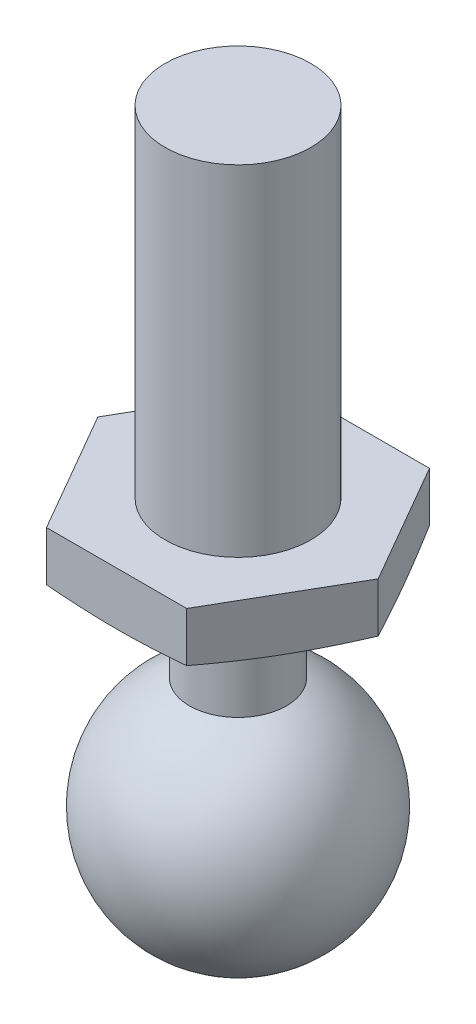
ISO-10303-21;
HEADER;
FILE_DESCRIPTION(('STEP AP214'),'2;1');
FILE_NAME('part.step','',(''),(''),'','','');
FILE_SCHEMA(('AUTOMOTIVE_DESIGN { 1 0 10303 214 1 1 1 1 }'));
ENDSEC;
DATA;
#1=APPLICATION_CONTEXT('core data for automotive mechanical design processes');
#2=APPLICATION_PROTOCOL_DEFINITION('international standard','automotive_design',2000,#1);
#3=PRODUCT_CONTEXT('',#1,'mechanical');
#4=PRODUCT('Part','Part','',(#3));
#5=PRODUCT_RELATED_PRODUCT_CATEGORY('part','',(#4));
#6=PRODUCT_DEFINITION_FORMATION('','',#4);
#7=PRODUCT_DEFINITION_CONTEXT('part definition',#1,'design');
#8=PRODUCT_DEFINITION('design','',#6,#7);
#9=PRODUCT_DEFINITION_SHAPE('','',#8);
#10=(LENGTH_UNIT() NAMED_UNIT(*) SI_UNIT(.MILLI.,.METRE.));
#11=(NAMED_UNIT(*) PLANE_ANGLE_UNIT() SI_UNIT($,.RADIAN.));
#12=(NAMED_UNIT(*) SI_UNIT($,.STERADIAN.) SOLID_ANGLE_UNIT());
#13=UNCERTAINTY_MEASURE_WITH_UNIT(LENGTH_MEASURE(1.E-05),#10,'distance_accuracy_value','');
#14=(GEOMETRIC_REPRESENTATION_CONTEXT(3) GLOBAL_UNCERTAINTY_ASSIGNED_CONTEXT((#13)) GLOBAL_UNIT_ASSIGNED_CONTEXT((#10,
#11,#12)) REPRESENTATION_CONTEXT('',''));
#15=CARTESIAN_POINT('',(0.,0.,0.));
#16=DIRECTION('',(0.,0.,1.));
#17=DIRECTION('',(1.,0.,0.));
#18=AXIS2_PLACEMENT_3D('',#15,#16,#17);
#19=CARTESIAN_POINT('',(0.,-1.35265396141693,0.));
#20=DIRECTION('',(0.,1.,0.));
#21=DIRECTION('',(0.,0.,1.));
#22=AXIS2_PLACEMENT_3D('',#19,#20,#21);
#23=CONICAL_SURFACE('',#22,1.,1.39626340159546);
#24=CARTESIAN_POINT('',(0.,-1.35265396141693,0.));
#25=DIRECTION('',(0.,-1.,0.));
#26=DIRECTION('',(0.,0.,-1.));
#27=AXIS2_PLACEMENT_3D('',#24,#25,#26);
#28=CIRCLE('',#27,1.);
#29=CARTESIAN_POINT('',(0.,-1.35265396141693,-1.));
#30=VERTEX_POINT('',#29);
#31=EDGE_CURVE('E46',#30,#30,#28,.T.);
#32=ORIENTED_EDGE('',*,*,#31,.F.);
#33=EDGE_LOOP('',(#32));
#34=FACE_BOUND('',#33,.T.);
#35=CARTESIAN_POINT('',(-4.35178786431024,-0.644036287997668,-2.5));
#36=CARTESIAN_POINT('',(-4.14193627308276,-0.676078443266939,-2.5));
#37=CARTESIAN_POINT('',(-3.9320061160949,-0.707637882512857,-2.5));
#38=CARTESIAN_POINT('',(-3.51189272953085,-0.769155320197357,-2.5));
#39=CARTESIAN_POINT('',(-3.30170947878789,-0.799113173573436,-2.5));
#40=CARTESIAN_POINT('',(-2.88017970644119,-0.856902233505525,-2.5));
#41=CARTESIAN_POINT('',(-2.66883192190967,-0.884724332295747,-2.5));
#42=CARTESIAN_POINT('',(-2.24570934242242,-0.937026760341865,-2.5));
#43=CARTESIAN_POINT('',(-2.03393453366674,-0.961506979784703,-2.5));
#44=CARTESIAN_POINT('',(-1.61240619275804,-1.00528012631561,-2.5));
#45=CARTESIAN_POINT('',(-1.40265893021013,-1.02463181983137,-2.5));
#46=CARTESIAN_POINT('',(-0.982648208636613,-1.05650898579663,-2.5));
#47=CARTESIAN_POINT('',(-0.772384815017567,-1.06903528244204,-2.5));
#48=CARTESIAN_POINT('',(-0.351902634676422,-1.08527841598575,-2.5));
#49=CARTESIAN_POINT('',(-0.141684541141491,-1.08901216350975,-2.5));
#50=CARTESIAN_POINT('',(0.278709004327902,-1.08698381304818,-2.5));
#51=CARTESIAN_POINT('',(0.488884455296936,-1.08122151985331,-2.5));
#52=CARTESIAN_POINT('',(0.851230925027751,-1.06403759142698,-2.5));
#53=CARTESIAN_POINT('',(1.00350351194761,-1.05460115450106,-2.5));
#54=CARTESIAN_POINT('',(1.30777400637347,-1.03208866040807,-2.5));
#55=CARTESIAN_POINT('',(1.45977191667072,-1.01901264043793,-2.5));
#56=CARTESIAN_POINT('',(1.76369841820404,-0.989977665999077,-2.5));
#57=CARTESIAN_POINT('',(1.91562662452937,-0.974014759231409,-2.5));
#58=CARTESIAN_POINT('',(2.2192375794225,-0.939897479711876,-2.5));
#59=CARTESIAN_POINT('',(2.37092032222341,-0.921743056208982,-2.5));
#60=CARTESIAN_POINT('',(2.67545249374304,-0.883603602011488,-2.5));
#61=CARTESIAN_POINT('',(2.82830001269499,-0.863603448459441,-2.5));
#62=CARTESIAN_POINT('',(3.13382217763901,-0.822324887162011,-2.5));
#63=CARTESIAN_POINT('',(3.28649682274871,-0.801046472921989,-2.5));
#64=CARTESIAN_POINT('',(3.59133987058711,-0.757569470849809,-2.5));
#65=CARTESIAN_POINT('',(3.74350860797057,-0.73537321814211,-2.5));
#66=CARTESIAN_POINT('',(4.04772858121144,-0.690221922288668,-2.5));
#67=CARTESIAN_POINT('',(4.19977982073275,-0.667266903868236,-2.5));
#68=CARTESIAN_POINT('',(4.35178786431024,-0.644036287997668,-2.5));
#69=B_SPLINE_CURVE_WITH_KNOTS('',3,(#35,#36,#37,#38,#39,#40,#41,#42,#43,#44,#45,#46,#47,#48,#49,
#50,#51,#52,#53,#54,#55,#56,#57,#58,#59,#60,#61,#62,#63,#64,#65,#66,#67,#68),.UNSPECIFIED.,.F.,
.F.,(4,2,2,2,2,2,2,2,2,2,2,2,2,2,2,2,4),(0.,0.636857995492099,1.27377357655624,1.91326959648742,
2.55278662499233,3.18462332153686,3.81638370417504,4.44692803219513,5.07748532242267,
5.53513200560773,5.9927740117676,6.45104736316598,6.90933132927127,7.37177581489304,
7.83422265032084,8.29555773886521,8.75687780903008),.UNSPECIFIED.);
#70=CARTESIAN_POINT('',(-1.44337567297406,-1.01996879323826,-2.5));
#71=VERTEX_POINT('',#70);
#72=CARTESIAN_POINT('',(1.44337567297407,-1.01996879323827,-2.5));
#73=VERTEX_POINT('',#72);
#74=EDGE_CURVE('E124',#71,#73,#69,.T.);
#75=ORIENTED_EDGE('',*,*,#74,.T.);
#76=CARTESIAN_POINT('',(1.44326020292023,-1.01994843153073,-2.5002));
#77=CARTESIAN_POINT('',(1.50332291805887,-1.03054468375176,-2.39616832573933));
#78=CARTESIAN_POINT('',(1.56343325575889,-1.04015113253336,-2.29205416678277));
#79=CARTESIAN_POINT('',(1.68374601000383,-1.0570130855626,-2.08366636363198));
#80=CARTESIAN_POINT('',(1.74394844050654,-1.06426818850539,-1.97939269526217));
#81=CARTESIAN_POINT('',(1.86428642853012,-1.07603900982871,-1.77096118592471));
#82=CARTESIAN_POINT('',(1.92442183257639,-1.08056084399192,-1.66680361078289));
#83=CARTESIAN_POINT('',(2.04472599629783,-1.08662296361426,-1.45843068685527));
#84=CARTESIAN_POINT('',(2.10489475287946,-1.08816349035423,-1.35421534342763));
#85=CARTESIAN_POINT('',(2.22523226604273,-1.08816349035423,-1.14578465657237));
#86=CARTESIAN_POINT('',(2.28540102262436,-1.08662296361426,-1.04156931314473));
#87=CARTESIAN_POINT('',(2.4057051863458,-1.08056084399192,-0.833196389217114));
#88=CARTESIAN_POINT('',(2.46584059039207,-1.07603900982871,-0.729038814075291));
#89=CARTESIAN_POINT('',(2.58617857841566,-1.06426818850539,-0.520607304737831));
#90=CARTESIAN_POINT('',(2.64638100891836,-1.0570130855626,-0.416333636368015));
#91=CARTESIAN_POINT('',(2.7666937631633,-1.04015113253336,-0.20794583321723));
#92=CARTESIAN_POINT('',(2.82680410086332,-1.03054468375176,-0.103831674260672));
#93=CARTESIAN_POINT('',(2.88686681600197,-1.01994843153073,0.000200000000000127));
#94=B_SPLINE_CURVE_WITH_KNOTS('',3,(#76,#77,#78,#79,#80,#81,#82,#83,#84,#85,#86,#87,#88,#89,#90,
#91,#92,#93),.UNSPECIFIED.,.F.,.F.,(4,2,2,2,2,2,2,2,4),(0.,0.361783441417082,0.723628596038175,
1.08466108341276,1.44566435076637,1.80666761811999,2.16770010549457,2.52954526011567,
2.89132870153275),.UNSPECIFIED.);
#95=CARTESIAN_POINT('',(2.88675134594813,-1.01996879323826,0.));
#96=VERTEX_POINT('',#95);
#97=EDGE_CURVE('E162',#73,#96,#94,.T.);
#98=ORIENTED_EDGE('',*,*,#97,.T.);
#99=CARTESIAN_POINT('',(2.88686681600197,-1.01994843153073,-0.000199999999999913));
#100=CARTESIAN_POINT('',(2.82680410086332,-1.03054468375176,0.103831674260672));
#101=CARTESIAN_POINT('',(2.7666937631633,-1.04015113253336,0.20794583321723));
#102=CARTESIAN_POINT('',(2.64638100891836,-1.0570130855626,0.416333636368015));
#103=CARTESIAN_POINT('',(2.58617857841566,-1.06426818850539,0.520607304737831));
#104=CARTESIAN_POINT('',(2.46584059039207,-1.07603900982871,0.729038814075291));
#105=CARTESIAN_POINT('',(2.4057051863458,-1.08056084399192,0.833196389217114));
#106=CARTESIAN_POINT('',(2.28540102262436,-1.08662296361426,1.04156931314473));
#107=CARTESIAN_POINT('',(2.22523226604273,-1.08816349035423,1.14578465657237));
#108=CARTESIAN_POINT('',(2.10489475287946,-1.08816349035423,1.35421534342763));
#109=CARTESIAN_POINT('',(2.04472599629783,-1.08662296361426,1.45843068685527));
#110=CARTESIAN_POINT('',(1.92442183257639,-1.08056084399192,1.66680361078289));
#111=CARTESIAN_POINT('',(1.86428642853012,-1.07603900982871,1.77096118592471));
#112=CARTESIAN_POINT('',(1.74394844050654,-1.06426818850539,1.97939269526217));
#113=CARTESIAN_POINT('',(1.68374601000383,-1.0570130855626,2.08366636363198));
#114=CARTESIAN_POINT('',(1.56343325575889,-1.04015113253337,2.29205416678277));
#115=CARTESIAN_POINT('',(1.50332291805887,-1.03054468375176,2.39616832573933));
#116=CARTESIAN_POINT('',(1.44326020292023,-1.01994843153073,2.5002));
#117=B_SPLINE_CURVE_WITH_KNOTS('',3,(#99,#100,#101,#102,#103,#104,#105,#106,#107,#108,#109,#110,
#111,#112,#113,#114,#115,#116),.UNSPECIFIED.,.F.,.F.,(4,2,2,2,2,2,2,2,4),(0.,0.361783441417082,
0.723628596038174,1.08466108341276,1.44566435076637,1.80666761811999,2.16770010549457,
2.52954526011566,2.89132870153275),.UNSPECIFIED.);
#118=CARTESIAN_POINT('',(1.44337567297406,-1.01996879323826,2.5));
#119=VERTEX_POINT('',#118);
#120=EDGE_CURVE('E171',#96,#119,#117,.T.);
#121=ORIENTED_EDGE('',*,*,#120,.T.);
#122=CARTESIAN_POINT('',(4.35178786431024,-0.644036287997668,2.5));
#123=CARTESIAN_POINT('',(4.14193627308276,-0.676078443266939,2.5));
#124=CARTESIAN_POINT('',(3.9320061160949,-0.707637882512857,2.5));
#125=CARTESIAN_POINT('',(3.51189272953085,-0.769155320197357,2.5));
#126=CARTESIAN_POINT('',(3.30170947878789,-0.799113173573437,2.5));
#127=CARTESIAN_POINT('',(2.88017970644119,-0.856902233505525,2.5));
#128=CARTESIAN_POINT('',(2.66883192190967,-0.884724332295747,2.5));
#129=CARTESIAN_POINT('',(2.24570934242242,-0.937026760341865,2.5));
#130=CARTESIAN_POINT('',(2.03393453366674,-0.961506979784703,2.5));
#131=CARTESIAN_POINT('',(1.61240619275804,-1.00528012631561,2.5));
#132=CARTESIAN_POINT('',(1.40265893021013,-1.02463181983137,2.5));
#133=CARTESIAN_POINT('',(0.982648208636613,-1.05650898579663,2.5));
#134=CARTESIAN_POINT('',(0.772384815017566,-1.06903528244204,2.5));
#135=CARTESIAN_POINT('',(0.351902634676421,-1.08527841598575,2.5));
#136=CARTESIAN_POINT('',(0.141684541141491,-1.08901216350975,2.5));
#137=CARTESIAN_POINT('',(-0.278709004327902,-1.08698381304818,2.5));
#138=CARTESIAN_POINT('',(-0.488884455296937,-1.08122151985331,2.5));
#139=CARTESIAN_POINT('',(-0.851230925027751,-1.06403759142698,2.5));
#140=CARTESIAN_POINT('',(-1.00350351194761,-1.05460115450106,2.5));
#141=CARTESIAN_POINT('',(-1.30777400637347,-1.03208866040807,2.5));
#142=CARTESIAN_POINT('',(-1.45977191667072,-1.01901264043793,2.5));
#143=CARTESIAN_POINT('',(-1.76369841820404,-0.989977665999077,2.5));
#144=CARTESIAN_POINT('',(-1.91562662452937,-0.974014759231409,2.5));
#145=CARTESIAN_POINT('',(-2.2192375794225,-0.939897479711876,2.5));
#146=CARTESIAN_POINT('',(-2.37092032222341,-0.921743056208982,2.5));
#147=CARTESIAN_POINT('',(-2.67545249374304,-0.883603602011488,2.5));
#148=CARTESIAN_POINT('',(-2.82830001269499,-0.863603448459441,2.5));
#149=CARTESIAN_POINT('',(-3.13382217763901,-0.822324887162012,2.5));
#150=CARTESIAN_POINT('',(-3.28649682274871,-0.801046472921989,2.5));
#151=CARTESIAN_POINT('',(-3.59133987058711,-0.757569470849809,2.5));
#152=CARTESIAN_POINT('',(-3.74350860797057,-0.735373218142111,2.5));
#153=CARTESIAN_POINT('',(-4.04772858121144,-0.690221922288668,2.5));
#154=CARTESIAN_POINT('',(-4.19977982073275,-0.667266903868237,2.5));
#155=CARTESIAN_POINT('',(-4.35178786431024,-0.644036287997668,2.5));
#156=B_SPLINE_CURVE_WITH_KNOTS('',3,(#122,#123,#124,#125,#126,#127,#128,#129,#130,#131,#132,
#133,#134,#135,#136,#137,#138,#139,#140,#141,#142,#143,#144,#145,#146,#147,#148,#149,#150,#151,
#152,#153,#154,#155),.UNSPECIFIED.,.F.,.F.,(4,2,2,2,2,2,2,2,2,2,2,2,2,2,2,2,4),(0.,
0.636857995492099,1.27377357655623,1.91326959648742,2.55278662499233,3.18462332153686,
3.81638370417504,4.44692803219513,5.07748532242267,5.53513200560773,5.9927740117676,
6.45104736316598,6.90933132927127,7.37177581489304,7.83422265032084,8.29555773886521,
8.75687780903008),.UNSPECIFIED.);
#157=CARTESIAN_POINT('',(-1.44337567297406,-1.01996879323826,2.5));
#158=VERTEX_POINT('',#157);
#159=EDGE_CURVE('E196',#119,#158,#156,.T.);
#160=ORIENTED_EDGE('',*,*,#159,.T.);
#161=CARTESIAN_POINT('',(-1.44326020292023,-1.01994843153073,2.5002));
#162=CARTESIAN_POINT('',(-1.50332291805887,-1.03054468375176,2.39616832573933));
#163=CARTESIAN_POINT('',(-1.56343325575889,-1.04015113253337,2.29205416678277));
#164=CARTESIAN_POINT('',(-1.68374601000383,-1.0570130855626,2.08366636363198));
#165=CARTESIAN_POINT('',(-1.74394844050654,-1.06426818850539,1.97939269526217));
#166=CARTESIAN_POINT('',(-1.86428642853012,-1.07603900982871,1.77096118592471));
#167=CARTESIAN_POINT('',(-1.92442183257639,-1.08056084399192,1.66680361078289));
#168=CARTESIAN_POINT('',(-2.04472599629783,-1.08662296361426,1.45843068685527));
#169=CARTESIAN_POINT('',(-2.10489475287946,-1.08816349035423,1.35421534342763));
#170=CARTESIAN_POINT('',(-2.22523226604273,-1.08816349035423,1.14578465657237));
#171=CARTESIAN_POINT('',(-2.28540102262436,-1.08662296361426,1.04156931314473));
#172=CARTESIAN_POINT('',(-2.4057051863458,-1.08056084399192,0.833196389217114));
#173=CARTESIAN_POINT('',(-2.46584059039207,-1.07603900982871,0.729038814075291));
#174=CARTESIAN_POINT('',(-2.58617857841566,-1.06426818850539,0.520607304737831));
#175=CARTESIAN_POINT('',(-2.64638100891836,-1.0570130855626,0.416333636368015));
#176=CARTESIAN_POINT('',(-2.7666937631633,-1.04015113253336,0.20794583321723));
#177=CARTESIAN_POINT('',(-2.82680410086332,-1.03054468375176,0.103831674260671));
#178=CARTESIAN_POINT('',(-2.88686681600197,-1.01994843153073,-0.000200000000000699));
#179=B_SPLINE_CURVE_WITH_KNOTS('',3,(#161,#162,#163,#164,#165,#166,#167,#168,#169,#170,#171,
#172,#173,#174,#175,#176,#177,#178),.UNSPECIFIED.,.F.,.F.,(4,2,2,2,2,2,2,2,4),(0.,
0.361783441417082,0.723628596038174,1.08466108341276,1.44566435076637,1.80666761811999,
2.16770010549457,2.52954526011567,2.89132870153275),.UNSPECIFIED.);
#180=CARTESIAN_POINT('',(-2.88675134594813,-1.01996879323826,0.));
#181=VERTEX_POINT('',#180);
#182=EDGE_CURVE('E197',#158,#181,#179,.T.);
#183=ORIENTED_EDGE('',*,*,#182,.T.);
#184=CARTESIAN_POINT('',(-2.88686681600197,-1.01994843153073,0.00019999999999957));
#185=CARTESIAN_POINT('',(-2.82680410086332,-1.03054468375176,-0.103831674260672));
#186=CARTESIAN_POINT('',(-2.7666937631633,-1.04015113253336,-0.207945833217231));
#187=CARTESIAN_POINT('',(-2.64638100891836,-1.0570130855626,-0.416333636368015));
#188=CARTESIAN_POINT('',(-2.58617857841566,-1.06426818850539,-0.520607304737831));
#189=CARTESIAN_POINT('',(-2.46584059039207,-1.07603900982871,-0.729038814075291));
#190=CARTESIAN_POINT('',(-2.4057051863458,-1.08056084399192,-0.833196389217114));
#191=CARTESIAN_POINT('',(-2.28540102262436,-1.08662296361426,-1.04156931314473));
#192=CARTESIAN_POINT('',(-2.22523226604273,-1.08816349035423,-1.14578465657237));
#193=CARTESIAN_POINT('',(-2.10489475287946,-1.08816349035423,-1.35421534342763));
#194=CARTESIAN_POINT('',(-2.04472599629783,-1.08662296361426,-1.45843068685527));
#195=CARTESIAN_POINT('',(-1.92442183257639,-1.08056084399192,-1.66680361078289));
#196=CARTESIAN_POINT('',(-1.86428642853012,-1.07603900982871,-1.77096118592471));
#197=CARTESIAN_POINT('',(-1.74394844050654,-1.06426818850539,-1.97939269526217));
#198=CARTESIAN_POINT('',(-1.68374601000383,-1.0570130855626,-2.08366636363198));
#199=CARTESIAN_POINT('',(-1.56343325575889,-1.04015113253337,-2.29205416678277));
#200=CARTESIAN_POINT('',(-1.50332291805887,-1.03054468375176,-2.39616832573933));
#201=CARTESIAN_POINT('',(-1.44326020292023,-1.01994843153073,-2.5002));
#202=B_SPLINE_CURVE_WITH_KNOTS('',3,(#184,#185,#186,#187,#188,#189,#190,#191,#192,#193,#194,
#195,#196,#197,#198,#199,#200,#201),.UNSPECIFIED.,.F.,.F.,(4,2,2,2,2,2,2,2,4),(0.,
0.361783441417082,0.723628596038174,1.08466108341276,1.44566435076637,1.80666761811999,
2.16770010549457,2.52954526011566,2.89132870153275),.UNSPECIFIED.);
#203=EDGE_CURVE('E94',#181,#71,#202,.T.);
#204=ORIENTED_EDGE('',*,*,#203,.T.);
#205=EDGE_LOOP('',(#75,#98,#121,#160,#183,#204));
#206=FACE_BOUND('',#205,.T.);
#207=ADVANCED_FACE('F38',(#34,#206),#23,.T.);
#208=CARTESIAN_POINT('',(0.,-5.5,0.));
#209=DIRECTION('',(0.,-1.,0.));
#210=DIRECTION('',(0.,0.,1.));
#211=AXIS2_PLACEMENT_3D('',#208,#209,#210);
#212=SPHERICAL_SURFACE('',#211,2.5);
#213=CARTESIAN_POINT('',(0.,-3.20871215252208,0.));
#214=DIRECTION('',(0.,-1.,0.));
#215=DIRECTION('',(0.,0.,-1.));
#216=AXIS2_PLACEMENT_3D('',#213,#214,#215);
#217=CIRCLE('',#216,1.);
#218=CARTESIAN_POINT('',(0.,-3.20871215252208,-1.));
#219=VERTEX_POINT('',#218);
#220=EDGE_CURVE('E12',#219,#219,#217,.T.);
#221=ORIENTED_EDGE('',*,*,#220,.T.);
#222=EDGE_LOOP('',(#221));
#223=FACE_BOUND('',#222,.T.);
#224=ADVANCED_FACE('F40',(#223),#212,.T.);
#225=CARTESIAN_POINT('',(0.,-8.,0.));
#226=DIRECTION('',(0.,-1.,0.));
#227=DIRECTION('',(0.,0.,-1.));
#228=AXIS2_PLACEMENT_3D('',#225,#226,#227);
#229=CYLINDRICAL_SURFACE('',#228,1.);
#230=ORIENTED_EDGE('',*,*,#31,.T.);
#231=EDGE_LOOP('',(#230));
#232=FACE_BOUND('',#231,.T.);
#233=ORIENTED_EDGE('',*,*,#220,.F.);
#234=EDGE_LOOP('',(#233));
#235=FACE_BOUND('',#234,.T.);
#236=ADVANCED_FACE('F158',(#232,#235),#229,.T.);
#237=CARTESIAN_POINT('',(2.88675134594813,-2.,0.));
#238=DIRECTION('',(0.866025403784439,0.,-0.5));
#239=DIRECTION('',(-0.5,0.,-0.866025403784439));
#240=AXIS2_PLACEMENT_3D('',#237,#238,#239);
#241=PLANE('',#240);
#242=DIRECTION('',(0.,1.,0.));
#243=VECTOR('',#242,1.);
#244=CARTESIAN_POINT('',(1.44337567297406,-2.,-2.5));
#245=LINE('',#244,#243);
#246=CARTESIAN_POINT('',(1.44337567297406,0.,-2.5));
#247=VERTEX_POINT('',#246);
#248=EDGE_CURVE('E53',#73,#247,#245,.T.);
#249=ORIENTED_EDGE('',*,*,#248,.T.);
#250=DIRECTION('',(-0.5,0.,-0.866025403784439));
#251=VECTOR('',#250,1.);
#252=CARTESIAN_POINT('',(2.88675134594813,0.,0.));
#253=LINE('',#252,#251);
#254=CARTESIAN_POINT('',(2.88675134594813,0.,0.));
#255=VERTEX_POINT('',#254);
#256=EDGE_CURVE('E115',#255,#247,#253,.T.);
#257=ORIENTED_EDGE('',*,*,#256,.F.);
#258=DIRECTION('',(0.,1.,0.));
#259=VECTOR('',#258,1.);
#260=CARTESIAN_POINT('',(2.88675134594813,-2.,0.));
#261=LINE('',#260,#259);
#262=EDGE_CURVE('E122',#96,#255,#261,.T.);
#263=ORIENTED_EDGE('',*,*,#262,.F.);
#264=ORIENTED_EDGE('',*,*,#97,.F.);
#265=EDGE_LOOP('',(#249,#257,#263,#264));
#266=FACE_BOUND('',#265,.T.);
#267=ADVANCED_FACE('F153',(#266),#241,.T.);
#268=CARTESIAN_POINT('',(1.44337567297406,-2.,2.5));
#269=DIRECTION('',(0.866025403784439,0.,0.5));
#270=DIRECTION('',(0.5,0.,-0.866025403784439));
#271=AXIS2_PLACEMENT_3D('',#268,#269,#270);
#272=PLANE('',#271);
#273=ORIENTED_EDGE('',*,*,#262,.T.);
#274=DIRECTION('',(0.5,0.,-0.866025403784439));
#275=VECTOR('',#274,1.);
#276=CARTESIAN_POINT('',(1.44337567297406,0.,2.5));
#277=LINE('',#276,#275);
#278=CARTESIAN_POINT('',(1.44337567297406,0.,2.5));
#279=VERTEX_POINT('',#278);
#280=EDGE_CURVE('E120',#279,#255,#277,.T.);
#281=ORIENTED_EDGE('',*,*,#280,.F.);
#282=DIRECTION('',(0.,1.,0.));
#283=VECTOR('',#282,1.);
#284=CARTESIAN_POINT('',(1.44337567297406,-2.,2.5));
#285=LINE('',#284,#283);
#286=EDGE_CURVE('E125',#119,#279,#285,.T.);
#287=ORIENTED_EDGE('',*,*,#286,.F.);
#288=ORIENTED_EDGE('',*,*,#120,.F.);
#289=EDGE_LOOP('',(#273,#281,#287,#288));
#290=FACE_BOUND('',#289,.T.);
#291=ADVANCED_FACE('F157',(#290),#272,.T.);
#292=CARTESIAN_POINT('',(-1.44337567297406,-2.,2.5));
#293=DIRECTION('',(0.,0.,1.));
#294=DIRECTION('',(1.,0.,0.));
#295=AXIS2_PLACEMENT_3D('',#292,#293,#294);
#296=PLANE('',#295);
#297=ORIENTED_EDGE('',*,*,#286,.T.);
#298=DIRECTION('',(1.,0.,0.));
#299=VECTOR('',#298,1.);
#300=CARTESIAN_POINT('',(-1.44337567297406,0.,2.5));
#301=LINE('',#300,#299);
#302=CARTESIAN_POINT('',(-1.44337567297406,0.,2.5));
#303=VERTEX_POINT('',#302);
#304=EDGE_CURVE('E107',#303,#279,#301,.T.);
#305=ORIENTED_EDGE('',*,*,#304,.F.);
#306=DIRECTION('',(0.,1.,0.));
#307=VECTOR('',#306,1.);
#308=CARTESIAN_POINT('',(-1.44337567297406,-2.,2.5));
#309=LINE('',#308,#307);
#310=EDGE_CURVE('E97',#158,#303,#309,.T.);
#311=ORIENTED_EDGE('',*,*,#310,.F.);
#312=ORIENTED_EDGE('',*,*,#159,.F.);
#313=EDGE_LOOP('',(#297,#305,#311,#312));
#314=FACE_BOUND('',#313,.T.);
#315=ADVANCED_FACE('F207',(#314),#296,.T.);
#316=CARTESIAN_POINT('',(-2.88675134594813,-2.,0.));
#317=DIRECTION('',(-0.866025403784439,0.,0.5));
#318=DIRECTION('',(0.5,0.,0.866025403784439));
#319=AXIS2_PLACEMENT_3D('',#316,#317,#318);
#320=PLANE('',#319);
#321=ORIENTED_EDGE('',*,*,#310,.T.);
#322=DIRECTION('',(0.5,0.,0.866025403784439));
#323=VECTOR('',#322,1.);
#324=CARTESIAN_POINT('',(-2.88675134594813,0.,0.));
#325=LINE('',#324,#323);
#326=CARTESIAN_POINT('',(-2.88675134594813,0.,0.));
#327=VERTEX_POINT('',#326);
#328=EDGE_CURVE('E101',#327,#303,#325,.T.);
#329=ORIENTED_EDGE('',*,*,#328,.F.);
#330=DIRECTION('',(0.,1.,0.));
#331=VECTOR('',#330,1.);
#332=CARTESIAN_POINT('',(-2.88675134594813,-2.,0.));
#333=LINE('',#332,#331);
#334=EDGE_CURVE('E90',#181,#327,#333,.T.);
#335=ORIENTED_EDGE('',*,*,#334,.F.);
#336=ORIENTED_EDGE('',*,*,#182,.F.);
#337=EDGE_LOOP('',(#321,#329,#335,#336));
#338=FACE_BOUND('',#337,.T.);
#339=ADVANCED_FACE('F102',(#338),#320,.T.);
#340=CARTESIAN_POINT('',(-1.44337567297406,-2.,-2.5));
#341=DIRECTION('',(-0.866025403784439,0.,-0.5));
#342=DIRECTION('',(-0.5,0.,0.866025403784439));
#343=AXIS2_PLACEMENT_3D('',#340,#341,#342);
#344=PLANE('',#343);
#345=ORIENTED_EDGE('',*,*,#334,.T.);
#346=DIRECTION('',(-0.5,0.,0.866025403784439));
#347=VECTOR('',#346,1.);
#348=CARTESIAN_POINT('',(-1.44337567297406,0.,-2.5));
#349=LINE('',#348,#347);
#350=CARTESIAN_POINT('',(-1.44337567297406,0.,-2.5));
#351=VERTEX_POINT('',#350);
#352=EDGE_CURVE('E61',#351,#327,#349,.T.);
#353=ORIENTED_EDGE('',*,*,#352,.F.);
#354=DIRECTION('',(0.,1.,0.));
#355=VECTOR('',#354,1.);
#356=CARTESIAN_POINT('',(-1.44337567297406,-2.,-2.5));
#357=LINE('',#356,#355);
#358=EDGE_CURVE('E98',#71,#351,#357,.T.);
#359=ORIENTED_EDGE('',*,*,#358,.F.);
#360=ORIENTED_EDGE('',*,*,#203,.F.);
#361=EDGE_LOOP('',(#345,#353,#359,#360));
#362=FACE_BOUND('',#361,.T.);
#363=ADVANCED_FACE('F92',(#362),#344,.T.);
#364=CARTESIAN_POINT('',(1.44337567297406,-2.,-2.5));
#365=DIRECTION('',(0.,0.,-1.));
#366=DIRECTION('',(-1.,0.,0.));
#367=AXIS2_PLACEMENT_3D('',#364,#365,#366);
#368=PLANE('',#367);
#369=ORIENTED_EDGE('',*,*,#358,.T.);
#370=DIRECTION('',(-1.,0.,0.));
#371=VECTOR('',#370,1.);
#372=CARTESIAN_POINT('',(1.44337567297406,0.,-2.5));
#373=LINE('',#372,#371);
#374=EDGE_CURVE('E113',#247,#351,#373,.T.);
#375=ORIENTED_EDGE('',*,*,#374,.F.);
#376=ORIENTED_EDGE('',*,*,#248,.F.);
#377=ORIENTED_EDGE('',*,*,#74,.F.);
#378=EDGE_LOOP('',(#369,#375,#376,#377));
#379=FACE_BOUND('',#378,.T.);
#380=ADVANCED_FACE('F146',(#379),#368,.T.);
#381=CARTESIAN_POINT('',(0.,7.,0.));
#382=DIRECTION('',(0.,1.,0.));
#383=DIRECTION('',(0.,0.,1.));
#384=AXIS2_PLACEMENT_3D('',#381,#382,#383);
#385=PLANE('',#384);
#386=CARTESIAN_POINT('',(0.,7.,0.));
#387=DIRECTION('',(0.,-1.,0.));
#388=DIRECTION('',(0.,0.,-1.));
#389=AXIS2_PLACEMENT_3D('',#386,#387,#388);
#390=CIRCLE('',#389,1.5);
#391=CARTESIAN_POINT('',(0.,7.,-1.5));
#392=VERTEX_POINT('',#391);
#393=EDGE_CURVE('E170',#392,#392,#390,.T.);
#394=ORIENTED_EDGE('',*,*,#393,.F.);
#395=EDGE_LOOP('',(#394));
#396=FACE_BOUND('',#395,.T.);
#397=ADVANCED_FACE('F150',(#396),#385,.T.);
#398=CARTESIAN_POINT('',(0.,-8.,0.));
#399=DIRECTION('',(0.,-1.,0.));
#400=DIRECTION('',(0.,0.,-1.));
#401=AXIS2_PLACEMENT_3D('',#398,#399,#400);
#402=CYLINDRICAL_SURFACE('',#401,1.5);
#403=ORIENTED_EDGE('',*,*,#393,.T.);
#404=EDGE_LOOP('',(#403));
#405=FACE_BOUND('',#404,.T.);
#406=CARTESIAN_POINT('',(0.,0.,0.));
#407=DIRECTION('',(0.,-1.,0.));
#408=DIRECTION('',(0.,0.,-1.));
#409=AXIS2_PLACEMENT_3D('',#406,#407,#408);
#410=CIRCLE('',#409,1.5);
#411=CARTESIAN_POINT('',(0.,0.,-1.5));
#412=VERTEX_POINT('',#411);
#413=EDGE_CURVE('E180',#412,#412,#410,.T.);
#414=ORIENTED_EDGE('',*,*,#413,.F.);
#415=EDGE_LOOP('',(#414));
#416=FACE_BOUND('',#415,.T.);
#417=ADVANCED_FACE('F230',(#405,#416),#402,.T.);
#418=CARTESIAN_POINT('',(0.,0.,-1.5));
#419=DIRECTION('',(0.,1.,0.));
#420=DIRECTION('',(0.,0.,1.));
#421=AXIS2_PLACEMENT_3D('',#418,#419,#420);
#422=PLANE('',#421);
#423=ORIENTED_EDGE('',*,*,#413,.T.);
#424=EDGE_LOOP('',(#423));
#425=FACE_BOUND('',#424,.T.);
#426=ORIENTED_EDGE('',*,*,#280,.T.);
#427=ORIENTED_EDGE('',*,*,#256,.T.);
#428=ORIENTED_EDGE('',*,*,#374,.T.);
#429=ORIENTED_EDGE('',*,*,#352,.T.);
#430=ORIENTED_EDGE('',*,*,#328,.T.);
#431=ORIENTED_EDGE('',*,*,#304,.T.);
#432=EDGE_LOOP('',(#426,#427,#428,#429,#430,#431));
#433=FACE_BOUND('',#432,.T.);
#434=ADVANCED_FACE('F111',(#425,#433),#422,.T.);
#435=CLOSED_SHELL('',(#207,#224,#236,#267,#291,#315,#339,#363,#380,#397,#417,#434));
#436=MANIFOLD_SOLID_BREP('B2',#435);
#437=ADVANCED_BREP_SHAPE_REPRESENTATION('',(#18,#436),#14);
#438=SHAPE_DEFINITION_REPRESENTATION(#9,#437);
ENDSEC;
END-ISO-10303-21;
